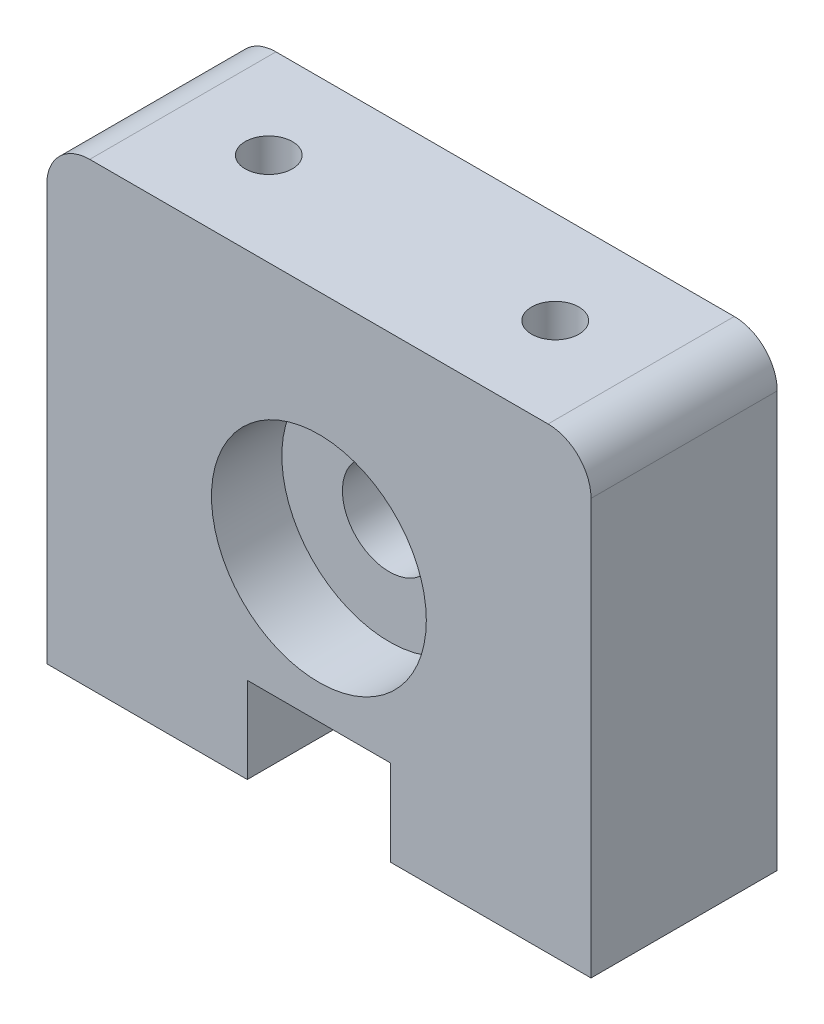
ISO-10303-21;
HEADER;
FILE_DESCRIPTION(('STEP AP214'),'2;1');
FILE_NAME('part.step','',(''),(''),'','','');
FILE_SCHEMA(('AUTOMOTIVE_DESIGN { 1 0 10303 214 1 1 1 1 }'));
ENDSEC;
DATA;
#1=APPLICATION_CONTEXT('core data for automotive mechanical design processes');
#2=APPLICATION_PROTOCOL_DEFINITION('international standard','automotive_design',2000,#1);
#3=PRODUCT_CONTEXT('',#1,'mechanical');
#4=PRODUCT('Part','Part','',(#3));
#5=PRODUCT_RELATED_PRODUCT_CATEGORY('part','',(#4));
#6=PRODUCT_DEFINITION_FORMATION('','',#4);
#7=PRODUCT_DEFINITION_CONTEXT('part definition',#1,'design');
#8=PRODUCT_DEFINITION('design','',#6,#7);
#9=PRODUCT_DEFINITION_SHAPE('','',#8);
#10=(LENGTH_UNIT() NAMED_UNIT(*) SI_UNIT(.MILLI.,.METRE.));
#11=(NAMED_UNIT(*) PLANE_ANGLE_UNIT() SI_UNIT($,.RADIAN.));
#12=(NAMED_UNIT(*) SI_UNIT($,.STERADIAN.) SOLID_ANGLE_UNIT());
#13=UNCERTAINTY_MEASURE_WITH_UNIT(LENGTH_MEASURE(1.E-05),#10,'distance_accuracy_value','');
#14=(GEOMETRIC_REPRESENTATION_CONTEXT(3) GLOBAL_UNCERTAINTY_ASSIGNED_CONTEXT((#13)) GLOBAL_UNIT_ASSIGNED_CONTEXT((#10,
#11,#12)) REPRESENTATION_CONTEXT('',''));
#15=CARTESIAN_POINT('',(0.,0.,0.));
#16=DIRECTION('',(0.,0.,1.));
#17=DIRECTION('',(1.,0.,0.));
#18=AXIS2_PLACEMENT_3D('',#15,#16,#17);
#19=CARTESIAN_POINT('',(0.,0.,13.));
#20=DIRECTION('',(0.,1.00000000000001,0.));
#21=DIRECTION('',(-1.00000000000001,0.,0.));
#22=AXIS2_PLACEMENT_3D('',#19,#20,#21);
#23=PLANE('',#22);
#24=CARTESIAN_POINT('',(-10.0000000000001,1.56125112837913E-13,6.5));
#25=DIRECTION('',(0.,-1.00000000000001,0.));
#26=DIRECTION('',(0.,0.,-1.));
#27=AXIS2_PLACEMENT_3D('',#24,#25,#26);
#28=CIRCLE('',#27,1.64999999999999);
#29=CARTESIAN_POINT('',(-10.0000000000001,1.56125112837913E-13,4.85000000000001));
#30=VERTEX_POINT('',#29);
#31=EDGE_CURVE('E521',#30,#30,#28,.T.);
#32=ORIENTED_EDGE('',*,*,#31,.F.);
#33=EDGE_LOOP('',(#32));
#34=FACE_BOUND('',#33,.T.);
#35=DIRECTION('',(1.00000000000001,0.,0.));
#36=VECTOR('',#35,1.);
#37=CARTESIAN_POINT('',(0.,0.,0.));
#38=LINE('',#37,#36);
#39=CARTESIAN_POINT('',(-19.,0.,0.));
#40=VERTEX_POINT('',#39);
#41=CARTESIAN_POINT('',(-5.,1.56125112837913E-13,0.));
#42=VERTEX_POINT('',#41);
#43=EDGE_CURVE('E167',#40,#42,#38,.T.);
#44=ORIENTED_EDGE('',*,*,#43,.T.);
#45=DIRECTION('',(0.,0.,1.));
#46=VECTOR('',#45,1.);
#47=CARTESIAN_POINT('',(-5.,0.,13.));
#48=LINE('',#47,#46);
#49=CARTESIAN_POINT('',(-5.,1.56125112837913E-13,13.));
#50=VERTEX_POINT('',#49);
#51=EDGE_CURVE('E62',#42,#50,#48,.T.);
#52=ORIENTED_EDGE('',*,*,#51,.T.);
#53=DIRECTION('',(1.00000000000001,0.,0.));
#54=VECTOR('',#53,1.);
#55=CARTESIAN_POINT('',(0.,0.,13.));
#56=LINE('',#55,#54);
#57=CARTESIAN_POINT('',(-19.,1.56125112837913E-13,13.));
#58=VERTEX_POINT('',#57);
#59=EDGE_CURVE('E131',#58,#50,#56,.T.);
#60=ORIENTED_EDGE('',*,*,#59,.F.);
#61=DIRECTION('',(0.,0.,-1.));
#62=VECTOR('',#61,1.);
#63=CARTESIAN_POINT('',(-19.,1.56125112837913E-13,13.));
#64=LINE('',#63,#62);
#65=EDGE_CURVE('E141',#58,#40,#64,.T.);
#66=ORIENTED_EDGE('',*,*,#65,.T.);
#67=EDGE_LOOP('',(#44,#52,#60,#66));
#68=FACE_BOUND('',#67,.T.);
#69=ADVANCED_FACE('F54',(#34,#68),#23,.F.);
#70=CARTESIAN_POINT('',(0.,15.8740000000002,13.));
#71=DIRECTION('',(0.,0.,-1.));
#72=DIRECTION('',(-1.00000000000001,0.,0.));
#73=AXIS2_PLACEMENT_3D('',#70,#71,#72);
#74=CYLINDRICAL_SURFACE('',#73,7.5);
#75=CARTESIAN_POINT('',(0.,15.8740000000002,0.));
#76=DIRECTION('',(0.,0.,1.));
#77=DIRECTION('',(1.00000000000001,0.,0.));
#78=AXIS2_PLACEMENT_3D('',#75,#76,#77);
#79=CIRCLE('',#78,7.5);
#80=CARTESIAN_POINT('',(7.50000000000008,15.8740000000002,0.));
#81=VERTEX_POINT('',#80);
#82=EDGE_CURVE('E186',#81,#81,#79,.T.);
#83=ORIENTED_EDGE('',*,*,#82,.F.);
#84=EDGE_LOOP('',(#83));
#85=FACE_BOUND('',#84,.T.);
#86=CARTESIAN_POINT('',(0.,15.8740000000002,4.9125));
#87=DIRECTION('',(0.,0.,1.));
#88=DIRECTION('',(1.00000000000001,0.,0.));
#89=AXIS2_PLACEMENT_3D('',#86,#87,#88);
#90=CIRCLE('',#89,7.5);
#91=CARTESIAN_POINT('',(7.50000000000008,15.8740000000002,4.9125));
#92=VERTEX_POINT('',#91);
#93=EDGE_CURVE('E183',#92,#92,#90,.T.);
#94=ORIENTED_EDGE('',*,*,#93,.T.);
#95=EDGE_LOOP('',(#94));
#96=FACE_BOUND('',#95,.T.);
#97=ADVANCED_FACE('F216',(#85,#96),#74,.F.);
#98=CARTESIAN_POINT('',(16.0000000000002,29.0000000000003,13.));
#99=DIRECTION('',(0.,0.,1.));
#100=DIRECTION('',(1.00000000000001,0.,0.));
#101=AXIS2_PLACEMENT_3D('',#98,#99,#100);
#102=PLANE('',#101);
#103=DIRECTION('',(0.,-1.,0.));
#104=VECTOR('',#103,1.);
#105=CARTESIAN_POINT('',(-5.,1.56125112837913E-13,13.));
#106=LINE('',#105,#104);
#107=CARTESIAN_POINT('',(-5.,6.00000000000016,13.));
#108=VERTEX_POINT('',#107);
#109=EDGE_CURVE('E496',#108,#50,#106,.T.);
#110=ORIENTED_EDGE('',*,*,#109,.F.);
#111=DIRECTION('',(-1.,0.,0.));
#112=VECTOR('',#111,1.);
#113=CARTESIAN_POINT('',(-5.,6.00000000000016,13.));
#114=LINE('',#113,#112);
#115=CARTESIAN_POINT('',(5.,6.00000000000016,13.));
#116=VERTEX_POINT('',#115);
#117=EDGE_CURVE('E504',#116,#108,#114,.T.);
#118=ORIENTED_EDGE('',*,*,#117,.F.);
#119=DIRECTION('',(0.,1.,0.));
#120=VECTOR('',#119,1.);
#121=CARTESIAN_POINT('',(5.,1.56125112837913E-13,13.));
#122=LINE('',#121,#120);
#123=CARTESIAN_POINT('',(5.,1.56125112837913E-13,13.));
#124=VERTEX_POINT('',#123);
#125=EDGE_CURVE('E505',#124,#116,#122,.T.);
#126=ORIENTED_EDGE('',*,*,#125,.F.);
#127=CARTESIAN_POINT('',(19.0000000000003,1.56125112837913E-13,13.0000000000001));
#128=VERTEX_POINT('',#127);
#129=EDGE_CURVE('E137',#124,#128,#56,.T.);
#130=ORIENTED_EDGE('',*,*,#129,.T.);
#131=DIRECTION('',(0.,1.00000000000001,0.));
#132=VECTOR('',#131,1.);
#133=CARTESIAN_POINT('',(19.0000000000003,1.56125112837913E-13,13.0000000000001));
#134=LINE('',#133,#132);
#135=CARTESIAN_POINT('',(19.0000000000003,29.0000000000003,13.0000000000001));
#136=VERTEX_POINT('',#135);
#137=EDGE_CURVE('E78',#128,#136,#134,.T.);
#138=ORIENTED_EDGE('',*,*,#137,.T.);
#139=CARTESIAN_POINT('',(16.0000000000002,29.0000000000003,13.));
#140=DIRECTION('',(0.,0.,1.));
#141=DIRECTION('',(1.00000000000001,0.,0.));
#142=AXIS2_PLACEMENT_3D('',#139,#140,#141);
#143=CIRCLE('',#142,3.);
#144=CARTESIAN_POINT('',(16.0000000000003,32.,13.));
#145=VERTEX_POINT('',#144);
#146=EDGE_CURVE('E170',#136,#145,#143,.T.);
#147=ORIENTED_EDGE('',*,*,#146,.T.);
#148=DIRECTION('',(-1.00000000000001,0.,0.));
#149=VECTOR('',#148,1.);
#150=CARTESIAN_POINT('',(-16.,32.0000000000003,13.0000000000001));
#151=LINE('',#150,#149);
#152=CARTESIAN_POINT('',(-16.,32.0000000000003,13.0000000000001));
#153=VERTEX_POINT('',#152);
#154=EDGE_CURVE('E114',#145,#153,#151,.T.);
#155=ORIENTED_EDGE('',*,*,#154,.T.);
#156=CARTESIAN_POINT('',(-16.,29.0000000000002,13.));
#157=DIRECTION('',(0.,0.,1.));
#158=DIRECTION('',(-1.00000000000001,0.,0.));
#159=AXIS2_PLACEMENT_3D('',#156,#157,#158);
#160=CIRCLE('',#159,3.);
#161=CARTESIAN_POINT('',(-19.,29.0000000000001,13.));
#162=VERTEX_POINT('',#161);
#163=EDGE_CURVE('E133',#153,#162,#160,.T.);
#164=ORIENTED_EDGE('',*,*,#163,.T.);
#165=DIRECTION('',(0.,-1.00000000000001,0.));
#166=VECTOR('',#165,1.);
#167=CARTESIAN_POINT('',(-19.,1.56125112837913E-13,13.));
#168=LINE('',#167,#166);
#169=EDGE_CURVE('E124',#162,#58,#168,.T.);
#170=ORIENTED_EDGE('',*,*,#169,.T.);
#171=ORIENTED_EDGE('',*,*,#59,.T.);
#172=EDGE_LOOP('',(#110,#118,#126,#130,#138,#147,#155,#164,#170,#171));
#173=FACE_BOUND('',#172,.T.);
#174=CARTESIAN_POINT('',(0.,15.8740000000002,13.));
#175=DIRECTION('',(0.,0.,1.));
#176=DIRECTION('',(1.00000000000001,0.,0.));
#177=AXIS2_PLACEMENT_3D('',#174,#175,#176);
#178=CIRCLE('',#177,7.5);
#179=CARTESIAN_POINT('',(7.50000000000008,15.8740000000002,13.));
#180=VERTEX_POINT('',#179);
#181=EDGE_CURVE('E161',#180,#180,#178,.T.);
#182=ORIENTED_EDGE('',*,*,#181,.F.);
#183=EDGE_LOOP('',(#182));
#184=FACE_BOUND('',#183,.T.);
#185=ADVANCED_FACE('F127',(#173,#184),#102,.T.);
#186=CARTESIAN_POINT('',(16.0000000000002,29.0000000000003,0.));
#187=DIRECTION('',(0.,0.,1.));
#188=DIRECTION('',(1.00000000000001,0.,0.));
#189=AXIS2_PLACEMENT_3D('',#186,#187,#188);
#190=PLANE('',#189);
#191=DIRECTION('',(-1.,0.,0.));
#192=VECTOR('',#191,1.);
#193=CARTESIAN_POINT('',(16.0000000000002,6.00000000000015,0.));
#194=LINE('',#193,#192);
#195=CARTESIAN_POINT('',(5.,6.00000000000016,0.));
#196=VERTEX_POINT('',#195);
#197=CARTESIAN_POINT('',(-5.,6.00000000000016,0.));
#198=VERTEX_POINT('',#197);
#199=EDGE_CURVE('E13',#196,#198,#194,.T.);
#200=ORIENTED_EDGE('',*,*,#199,.T.);
#201=DIRECTION('',(0.,-1.,0.));
#202=VECTOR('',#201,1.);
#203=CARTESIAN_POINT('',(-5.,29.0000000000003,0.));
#204=LINE('',#203,#202);
#205=EDGE_CURVE('E249',#198,#42,#204,.T.);
#206=ORIENTED_EDGE('',*,*,#205,.T.);
#207=ORIENTED_EDGE('',*,*,#43,.F.);
#208=DIRECTION('',(0.,-1.00000000000001,0.));
#209=VECTOR('',#208,1.);
#210=CARTESIAN_POINT('',(-19.,0.,0.));
#211=LINE('',#210,#209);
#212=CARTESIAN_POINT('',(-19.,29.0000000000003,0.));
#213=VERTEX_POINT('',#212);
#214=EDGE_CURVE('E144',#213,#40,#211,.T.);
#215=ORIENTED_EDGE('',*,*,#214,.F.);
#216=CARTESIAN_POINT('',(-16.,29.0000000000003,0.));
#217=DIRECTION('',(0.,0.,1.));
#218=DIRECTION('',(-1.00000000000001,0.,0.));
#219=AXIS2_PLACEMENT_3D('',#216,#217,#218);
#220=CIRCLE('',#219,3.);
#221=CARTESIAN_POINT('',(-16.,32.0000000000003,0.));
#222=VERTEX_POINT('',#221);
#223=EDGE_CURVE('E163',#222,#213,#220,.T.);
#224=ORIENTED_EDGE('',*,*,#223,.F.);
#225=DIRECTION('',(-1.00000000000001,0.,0.));
#226=VECTOR('',#225,1.);
#227=CARTESIAN_POINT('',(-16.,32.0000000000003,0.));
#228=LINE('',#227,#226);
#229=CARTESIAN_POINT('',(16.0000000000003,32.,0.));
#230=VERTEX_POINT('',#229);
#231=EDGE_CURVE('E160',#230,#222,#228,.T.);
#232=ORIENTED_EDGE('',*,*,#231,.F.);
#233=CARTESIAN_POINT('',(16.0000000000002,29.0000000000003,0.));
#234=DIRECTION('',(0.,0.,1.));
#235=DIRECTION('',(1.00000000000001,0.,0.));
#236=AXIS2_PLACEMENT_3D('',#233,#234,#235);
#237=CIRCLE('',#236,3.);
#238=CARTESIAN_POINT('',(19.0000000000003,29.0000000000003,0.));
#239=VERTEX_POINT('',#238);
#240=EDGE_CURVE('E157',#239,#230,#237,.T.);
#241=ORIENTED_EDGE('',*,*,#240,.F.);
#242=DIRECTION('',(0.,1.00000000000001,0.));
#243=VECTOR('',#242,1.);
#244=CARTESIAN_POINT('',(19.0000000000003,1.56125112837913E-13,0.));
#245=LINE('',#244,#243);
#246=CARTESIAN_POINT('',(19.0000000000003,1.56125112837913E-13,0.));
#247=VERTEX_POINT('',#246);
#248=EDGE_CURVE('E105',#247,#239,#245,.T.);
#249=ORIENTED_EDGE('',*,*,#248,.F.);
#250=CARTESIAN_POINT('',(5.0000000000001,0.,0.));
#251=VERTEX_POINT('',#250);
#252=EDGE_CURVE('E166',#251,#247,#38,.T.);
#253=ORIENTED_EDGE('',*,*,#252,.F.);
#254=DIRECTION('',(0.,1.,0.));
#255=VECTOR('',#254,1.);
#256=CARTESIAN_POINT('',(5.,29.0000000000003,0.));
#257=LINE('',#256,#255);
#258=EDGE_CURVE('E69',#251,#196,#257,.T.);
#259=ORIENTED_EDGE('',*,*,#258,.T.);
#260=EDGE_LOOP('',(#200,#206,#207,#215,#224,#232,#241,#249,#253,#259));
#261=FACE_BOUND('',#260,.T.);
#262=ORIENTED_EDGE('',*,*,#82,.T.);
#263=EDGE_LOOP('',(#262));
#264=FACE_BOUND('',#263,.T.);
#265=ADVANCED_FACE('F197',(#261,#264),#190,.F.);
#266=CARTESIAN_POINT('',(16.0000000000002,29.0000000000003,13.));
#267=DIRECTION('',(0.,0.,-1.));
#268=DIRECTION('',(-1.00000000000001,0.,0.));
#269=AXIS2_PLACEMENT_3D('',#266,#267,#268);
#270=CYLINDRICAL_SURFACE('',#269,3.);
#271=ORIENTED_EDGE('',*,*,#240,.T.);
#272=DIRECTION('',(0.,0.,-1.));
#273=VECTOR('',#272,1.);
#274=CARTESIAN_POINT('',(16.0000000000003,32.,13.));
#275=LINE('',#274,#273);
#276=EDGE_CURVE('E177',#145,#230,#275,.T.);
#277=ORIENTED_EDGE('',*,*,#276,.F.);
#278=ORIENTED_EDGE('',*,*,#146,.F.);
#279=DIRECTION('',(0.,0.,-1.));
#280=VECTOR('',#279,1.);
#281=CARTESIAN_POINT('',(19.0000000000003,29.0000000000003,13.0000000000001));
#282=LINE('',#281,#280);
#283=EDGE_CURVE('E153',#136,#239,#282,.T.);
#284=ORIENTED_EDGE('',*,*,#283,.T.);
#285=EDGE_LOOP('',(#271,#277,#278,#284));
#286=FACE_BOUND('',#285,.T.);
#287=ADVANCED_FACE('F56',(#286),#270,.T.);
#288=CARTESIAN_POINT('',(-16.,32.0000000000003,13.0000000000001));
#289=DIRECTION('',(0.,-1.00000000000001,0.));
#290=DIRECTION('',(0.,0.,-1.));
#291=AXIS2_PLACEMENT_3D('',#288,#289,#290);
#292=PLANE('',#291);
#293=CARTESIAN_POINT('',(-10.0000000000001,32.0000000000003,6.5));
#294=DIRECTION('',(0.,1.00000000000001,0.));
#295=DIRECTION('',(0.,0.,1.));
#296=AXIS2_PLACEMENT_3D('',#293,#294,#295);
#297=CIRCLE('',#296,1.64999999999999);
#298=CARTESIAN_POINT('',(-10.0000000000001,32.0000000000003,8.14999999999999));
#299=VERTEX_POINT('',#298);
#300=EDGE_CURVE('E242',#299,#299,#297,.T.);
#301=ORIENTED_EDGE('',*,*,#300,.F.);
#302=EDGE_LOOP('',(#301));
#303=FACE_BOUND('',#302,.T.);
#304=CARTESIAN_POINT('',(10.,32.0000000000003,6.5));
#305=DIRECTION('',(0.,1.00000000000001,0.));
#306=DIRECTION('',(0.,0.,1.));
#307=AXIS2_PLACEMENT_3D('',#304,#305,#306);
#308=CIRCLE('',#307,1.64999999999999);
#309=CARTESIAN_POINT('',(10.,32.0000000000003,8.14999999999999));
#310=VERTEX_POINT('',#309);
#311=EDGE_CURVE('E245',#310,#310,#308,.T.);
#312=ORIENTED_EDGE('',*,*,#311,.F.);
#313=EDGE_LOOP('',(#312));
#314=FACE_BOUND('',#313,.T.);
#315=ORIENTED_EDGE('',*,*,#231,.T.);
#316=DIRECTION('',(0.,0.,-1.));
#317=VECTOR('',#316,1.);
#318=CARTESIAN_POINT('',(-16.,32.0000000000003,13.0000000000001));
#319=LINE('',#318,#317);
#320=EDGE_CURVE('E174',#153,#222,#319,.T.);
#321=ORIENTED_EDGE('',*,*,#320,.F.);
#322=ORIENTED_EDGE('',*,*,#154,.F.);
#323=ORIENTED_EDGE('',*,*,#276,.T.);
#324=EDGE_LOOP('',(#315,#321,#322,#323));
#325=FACE_BOUND('',#324,.T.);
#326=ADVANCED_FACE('F232',(#303,#314,#325),#292,.F.);
#327=CARTESIAN_POINT('',(-16.,29.0000000000002,13.));
#328=DIRECTION('',(0.,0.,-1.));
#329=DIRECTION('',(-1.00000000000001,0.,0.));
#330=AXIS2_PLACEMENT_3D('',#327,#328,#329);
#331=CYLINDRICAL_SURFACE('',#330,3.);
#332=ORIENTED_EDGE('',*,*,#223,.T.);
#333=DIRECTION('',(0.,0.,-1.));
#334=VECTOR('',#333,1.);
#335=CARTESIAN_POINT('',(-19.,29.0000000000001,13.));
#336=LINE('',#335,#334);
#337=EDGE_CURVE('E147',#162,#213,#336,.T.);
#338=ORIENTED_EDGE('',*,*,#337,.F.);
#339=ORIENTED_EDGE('',*,*,#163,.F.);
#340=ORIENTED_EDGE('',*,*,#320,.T.);
#341=EDGE_LOOP('',(#332,#338,#339,#340));
#342=FACE_BOUND('',#341,.T.);
#343=ADVANCED_FACE('F230',(#342),#331,.T.);
#344=CARTESIAN_POINT('',(-19.,1.56125112837913E-13,13.));
#345=DIRECTION('',(1.00000000000001,0.,0.));
#346=DIRECTION('',(0.,0.,-1.));
#347=AXIS2_PLACEMENT_3D('',#344,#345,#346);
#348=PLANE('',#347);
#349=ORIENTED_EDGE('',*,*,#214,.T.);
#350=ORIENTED_EDGE('',*,*,#65,.F.);
#351=ORIENTED_EDGE('',*,*,#169,.F.);
#352=ORIENTED_EDGE('',*,*,#337,.T.);
#353=EDGE_LOOP('',(#349,#350,#351,#352));
#354=FACE_BOUND('',#353,.T.);
#355=ADVANCED_FACE('F142',(#354),#348,.F.);
#356=CARTESIAN_POINT('',(10.,0.,6.5));
#357=DIRECTION('',(0.,-1.00000000000001,0.));
#358=DIRECTION('',(0.,0.,-1.));
#359=AXIS2_PLACEMENT_3D('',#356,#357,#358);
#360=CIRCLE('',#359,1.64999999999999);
#361=CARTESIAN_POINT('',(10.,0.,4.85000000000001));
#362=VERTEX_POINT('',#361);
#363=EDGE_CURVE('E278',#362,#362,#360,.T.);
#364=ORIENTED_EDGE('',*,*,#363,.F.);
#365=EDGE_LOOP('',(#364));
#366=FACE_BOUND('',#365,.T.);
#367=ORIENTED_EDGE('',*,*,#129,.F.);
#368=DIRECTION('',(0.,0.,-1.));
#369=VECTOR('',#368,1.);
#370=CARTESIAN_POINT('',(5.,0.,13.));
#371=LINE('',#370,#369);
#372=EDGE_CURVE('E182',#124,#251,#371,.T.);
#373=ORIENTED_EDGE('',*,*,#372,.T.);
#374=ORIENTED_EDGE('',*,*,#252,.T.);
#375=DIRECTION('',(0.,0.,-1.));
#376=VECTOR('',#375,1.);
#377=CARTESIAN_POINT('',(19.0000000000003,1.56125112837913E-13,13.0000000000001));
#378=LINE('',#377,#376);
#379=EDGE_CURVE('E148',#128,#247,#378,.T.);
#380=ORIENTED_EDGE('',*,*,#379,.F.);
#381=EDGE_LOOP('',(#367,#373,#374,#380));
#382=FACE_BOUND('',#381,.T.);
#383=ADVANCED_FACE('F191',(#366,#382),#23,.F.);
#384=CARTESIAN_POINT('',(19.0000000000003,1.56125112837913E-13,13.0000000000001));
#385=DIRECTION('',(-1.00000000000001,0.,0.));
#386=DIRECTION('',(0.,0.,1.));
#387=AXIS2_PLACEMENT_3D('',#384,#385,#386);
#388=PLANE('',#387);
#389=ORIENTED_EDGE('',*,*,#248,.T.);
#390=ORIENTED_EDGE('',*,*,#283,.F.);
#391=ORIENTED_EDGE('',*,*,#137,.F.);
#392=ORIENTED_EDGE('',*,*,#379,.T.);
#393=EDGE_LOOP('',(#389,#390,#391,#392));
#394=FACE_BOUND('',#393,.T.);
#395=ADVANCED_FACE('F205',(#394),#388,.F.);
#396=CARTESIAN_POINT('',(0.,15.8740000000002,8.0875));
#397=DIRECTION('',(0.,0.,1.));
#398=DIRECTION('',(1.00000000000001,0.,0.));
#399=AXIS2_PLACEMENT_3D('',#396,#397,#398);
#400=CIRCLE('',#399,7.5);
#401=CARTESIAN_POINT('',(7.50000000000008,15.8740000000002,8.0875));
#402=VERTEX_POINT('',#401);
#403=EDGE_CURVE('E179',#402,#402,#400,.T.);
#404=ORIENTED_EDGE('',*,*,#403,.F.);
#405=EDGE_LOOP('',(#404));
#406=FACE_BOUND('',#405,.T.);
#407=ORIENTED_EDGE('',*,*,#181,.T.);
#408=EDGE_LOOP('',(#407));
#409=FACE_BOUND('',#408,.T.);
#410=ADVANCED_FACE('F207',(#406,#409),#74,.F.);
#411=CARTESIAN_POINT('',(0.,15.8740000000002,4.9125));
#412=DIRECTION('',(0.,0.,1.));
#413=DIRECTION('',(1.00000000000001,0.,0.));
#414=AXIS2_PLACEMENT_3D('',#411,#412,#413);
#415=PLANE('',#414);
#416=ORIENTED_EDGE('',*,*,#93,.F.);
#417=EDGE_LOOP('',(#416));
#418=FACE_BOUND('',#417,.T.);
#419=CARTESIAN_POINT('',(0.,15.8740000000002,4.9125));
#420=DIRECTION('',(0.,0.,1.));
#421=DIRECTION('',(1.00000000000001,0.,0.));
#422=AXIS2_PLACEMENT_3D('',#419,#420,#421);
#423=CIRCLE('',#422,3.27025);
#424=CARTESIAN_POINT('',(3.27025000000003,15.8740000000002,4.9125));
#425=VERTEX_POINT('',#424);
#426=EDGE_CURVE('E187',#425,#425,#423,.T.);
#427=ORIENTED_EDGE('',*,*,#426,.T.);
#428=EDGE_LOOP('',(#427));
#429=FACE_BOUND('',#428,.T.);
#430=ADVANCED_FACE('F213',(#418,#429),#415,.F.);
#431=CARTESIAN_POINT('',(0.,15.8740000000002,4.9125));
#432=DIRECTION('',(0.,0.,1.));
#433=DIRECTION('',(1.00000000000001,0.,0.));
#434=AXIS2_PLACEMENT_3D('',#431,#432,#433);
#435=CYLINDRICAL_SURFACE('',#434,3.27025);
#436=ORIENTED_EDGE('',*,*,#426,.F.);
#437=EDGE_LOOP('',(#436));
#438=FACE_BOUND('',#437,.T.);
#439=CARTESIAN_POINT('',(0.,15.8740000000002,8.0875));
#440=DIRECTION('',(0.,0.,1.));
#441=DIRECTION('',(1.00000000000001,0.,0.));
#442=AXIS2_PLACEMENT_3D('',#439,#440,#441);
#443=CIRCLE('',#442,3.27025);
#444=CARTESIAN_POINT('',(3.27025000000003,15.8740000000002,8.0875));
#445=VERTEX_POINT('',#444);
#446=EDGE_CURVE('E277',#445,#445,#443,.T.);
#447=ORIENTED_EDGE('',*,*,#446,.T.);
#448=EDGE_LOOP('',(#447));
#449=FACE_BOUND('',#448,.T.);
#450=ADVANCED_FACE('F300',(#438,#449),#435,.F.);
#451=CARTESIAN_POINT('',(0.,15.8740000000002,8.0875));
#452=DIRECTION('',(0.,0.,1.));
#453=DIRECTION('',(1.00000000000001,0.,0.));
#454=AXIS2_PLACEMENT_3D('',#451,#452,#453);
#455=PLANE('',#454);
#456=ORIENTED_EDGE('',*,*,#403,.T.);
#457=EDGE_LOOP('',(#456));
#458=FACE_BOUND('',#457,.T.);
#459=ORIENTED_EDGE('',*,*,#446,.F.);
#460=EDGE_LOOP('',(#459));
#461=FACE_BOUND('',#460,.T.);
#462=ADVANCED_FACE('F271',(#458,#461),#455,.T.);
#463=CARTESIAN_POINT('',(10.0000000000001,10.1092000000002,6.5));
#464=DIRECTION('',(0.,-1.00000000000001,0.));
#465=DIRECTION('',(0.,0.,-1.));
#466=AXIS2_PLACEMENT_3D('',#463,#464,#465);
#467=CONICAL_SURFACE('',#466,1.65,1.02974425867665);
#468=CARTESIAN_POINT('',(10.0000000000001,11.1006200213956,6.5));
#469=VERTEX_POINT('',#468);
#470=VERTEX_LOOP('',#469);
#471=FACE_BOUND('',#470,.T.);
#472=CARTESIAN_POINT('',(10.0000000000001,10.1092000000002,6.5));
#473=DIRECTION('',(0.,-1.00000000000001,0.));
#474=DIRECTION('',(0.,0.,-1.));
#475=AXIS2_PLACEMENT_3D('',#472,#473,#474);
#476=CIRCLE('',#475,1.65);
#477=CARTESIAN_POINT('',(10.0000000000001,10.1092000000002,4.85));
#478=VERTEX_POINT('',#477);
#479=EDGE_CURVE('E275',#478,#478,#476,.T.);
#480=ORIENTED_EDGE('',*,*,#479,.T.);
#481=EDGE_LOOP('',(#480));
#482=FACE_BOUND('',#481,.T.);
#483=ADVANCED_FACE('F267',(#471,#482),#467,.F.);
#484=CARTESIAN_POINT('',(10.,0.,6.5));
#485=DIRECTION('',(0.,-1.00000000000001,0.));
#486=DIRECTION('',(0.,0.,-1.));
#487=AXIS2_PLACEMENT_3D('',#484,#485,#486);
#488=CYLINDRICAL_SURFACE('',#487,1.64999999999999);
#489=ORIENTED_EDGE('',*,*,#479,.F.);
#490=EDGE_LOOP('',(#489));
#491=FACE_BOUND('',#490,.T.);
#492=ORIENTED_EDGE('',*,*,#363,.T.);
#493=EDGE_LOOP('',(#492));
#494=FACE_BOUND('',#493,.T.);
#495=ADVANCED_FACE('F270',(#491,#494),#488,.F.);
#496=CARTESIAN_POINT('',(-10.0000000000001,10.1092000000001,6.5));
#497=DIRECTION('',(0.,-1.00000000000001,0.));
#498=DIRECTION('',(0.,0.,-1.));
#499=AXIS2_PLACEMENT_3D('',#496,#497,#498);
#500=CONICAL_SURFACE('',#499,1.65,1.02974425867665);
#501=CARTESIAN_POINT('',(-10.0000000000001,11.1006200213956,6.5));
#502=VERTEX_POINT('',#501);
#503=VERTEX_LOOP('',#502);
#504=FACE_BOUND('',#503,.T.);
#505=CARTESIAN_POINT('',(-10.0000000000001,10.1092000000001,6.5));
#506=DIRECTION('',(0.,-1.00000000000001,0.));
#507=DIRECTION('',(0.,0.,-1.));
#508=AXIS2_PLACEMENT_3D('',#505,#506,#507);
#509=CIRCLE('',#508,1.65);
#510=CARTESIAN_POINT('',(-10.0000000000001,10.1092000000001,4.85));
#511=VERTEX_POINT('',#510);
#512=EDGE_CURVE('E283',#511,#511,#509,.T.);
#513=ORIENTED_EDGE('',*,*,#512,.T.);
#514=EDGE_LOOP('',(#513));
#515=FACE_BOUND('',#514,.T.);
#516=ADVANCED_FACE('F392',(#504,#515),#500,.F.);
#517=CARTESIAN_POINT('',(-10.0000000000001,1.56125112837913E-13,6.5));
#518=DIRECTION('',(0.,-1.00000000000001,0.));
#519=DIRECTION('',(0.,0.,-1.));
#520=AXIS2_PLACEMENT_3D('',#517,#518,#519);
#521=CYLINDRICAL_SURFACE('',#520,1.64999999999999);
#522=ORIENTED_EDGE('',*,*,#512,.F.);
#523=EDGE_LOOP('',(#522));
#524=FACE_BOUND('',#523,.T.);
#525=ORIENTED_EDGE('',*,*,#31,.T.);
#526=EDGE_LOOP('',(#525));
#527=FACE_BOUND('',#526,.T.);
#528=ADVANCED_FACE('F401',(#524,#527),#521,.F.);
#529=CARTESIAN_POINT('',(10.0000000000001,22.0000000000002,6.5));
#530=DIRECTION('',(0.,1.00000000000001,0.));
#531=DIRECTION('',(0.,0.,1.));
#532=AXIS2_PLACEMENT_3D('',#529,#530,#531);
#533=CONICAL_SURFACE('',#532,1.64999999999999,1.02974425867665);
#534=CARTESIAN_POINT('',(10.0000000000001,21.0085799786047,6.5));
#535=VERTEX_POINT('',#534);
#536=VERTEX_LOOP('',#535);
#537=FACE_BOUND('',#536,.T.);
#538=CARTESIAN_POINT('',(10.0000000000001,22.0000000000002,6.5));
#539=DIRECTION('',(0.,1.00000000000001,0.));
#540=DIRECTION('',(0.,0.,1.));
#541=AXIS2_PLACEMENT_3D('',#538,#539,#540);
#542=CIRCLE('',#541,1.64999999999999);
#543=CARTESIAN_POINT('',(10.0000000000001,22.0000000000002,8.14999999999999));
#544=VERTEX_POINT('',#543);
#545=EDGE_CURVE('E518',#544,#544,#542,.T.);
#546=ORIENTED_EDGE('',*,*,#545,.T.);
#547=EDGE_LOOP('',(#546));
#548=FACE_BOUND('',#547,.T.);
#549=ADVANCED_FACE('F410',(#537,#548),#533,.F.);
#550=CARTESIAN_POINT('',(10.,32.0000000000003,6.5));
#551=DIRECTION('',(0.,1.00000000000001,0.));
#552=DIRECTION('',(0.,0.,1.));
#553=AXIS2_PLACEMENT_3D('',#550,#551,#552);
#554=CYLINDRICAL_SURFACE('',#553,1.64999999999999);
#555=ORIENTED_EDGE('',*,*,#545,.F.);
#556=EDGE_LOOP('',(#555));
#557=FACE_BOUND('',#556,.T.);
#558=ORIENTED_EDGE('',*,*,#311,.T.);
#559=EDGE_LOOP('',(#558));
#560=FACE_BOUND('',#559,.T.);
#561=ADVANCED_FACE('F421',(#557,#560),#554,.F.);
#562=CARTESIAN_POINT('',(-10.0000000000001,22.0000000000003,6.5));
#563=DIRECTION('',(0.,1.00000000000001,0.));
#564=DIRECTION('',(0.,0.,1.));
#565=AXIS2_PLACEMENT_3D('',#562,#563,#564);
#566=CONICAL_SURFACE('',#565,1.64999999999999,1.02974425867665);
#567=CARTESIAN_POINT('',(-10.0000000000001,21.0085799786048,6.5));
#568=VERTEX_POINT('',#567);
#569=VERTEX_LOOP('',#568);
#570=FACE_BOUND('',#569,.T.);
#571=CARTESIAN_POINT('',(-10.0000000000001,22.0000000000003,6.5));
#572=DIRECTION('',(0.,1.00000000000001,0.));
#573=DIRECTION('',(0.,0.,1.));
#574=AXIS2_PLACEMENT_3D('',#571,#572,#573);
#575=CIRCLE('',#574,1.64999999999999);
#576=CARTESIAN_POINT('',(-10.0000000000001,22.0000000000003,8.14999999999998));
#577=VERTEX_POINT('',#576);
#578=EDGE_CURVE('E514',#577,#577,#575,.T.);
#579=ORIENTED_EDGE('',*,*,#578,.T.);
#580=EDGE_LOOP('',(#579));
#581=FACE_BOUND('',#580,.T.);
#582=ADVANCED_FACE('F431',(#570,#581),#566,.F.);
#583=CARTESIAN_POINT('',(-10.0000000000001,32.0000000000003,6.5));
#584=DIRECTION('',(0.,1.00000000000001,0.));
#585=DIRECTION('',(0.,0.,1.));
#586=AXIS2_PLACEMENT_3D('',#583,#584,#585);
#587=CYLINDRICAL_SURFACE('',#586,1.64999999999999);
#588=ORIENTED_EDGE('',*,*,#578,.F.);
#589=EDGE_LOOP('',(#588));
#590=FACE_BOUND('',#589,.T.);
#591=ORIENTED_EDGE('',*,*,#300,.T.);
#592=EDGE_LOOP('',(#591));
#593=FACE_BOUND('',#592,.T.);
#594=ADVANCED_FACE('F442',(#590,#593),#587,.F.);
#595=CARTESIAN_POINT('',(-5.,6.00000000000016,-2.));
#596=DIRECTION('',(0.,1.,0.));
#597=DIRECTION('',(0.,0.,1.));
#598=AXIS2_PLACEMENT_3D('',#595,#596,#597);
#599=PLANE('',#598);
#600=DIRECTION('',(0.,0.,1.));
#601=VECTOR('',#600,1.);
#602=CARTESIAN_POINT('',(5.,6.00000000000016,-2.));
#603=LINE('',#602,#601);
#604=EDGE_CURVE('E500',#196,#116,#603,.T.);
#605=ORIENTED_EDGE('',*,*,#604,.T.);
#606=ORIENTED_EDGE('',*,*,#117,.T.);
#607=DIRECTION('',(0.,0.,1.));
#608=VECTOR('',#607,1.);
#609=CARTESIAN_POINT('',(-5.,6.00000000000016,-2.));
#610=LINE('',#609,#608);
#611=EDGE_CURVE('E494',#198,#108,#610,.T.);
#612=ORIENTED_EDGE('',*,*,#611,.F.);
#613=ORIENTED_EDGE('',*,*,#199,.F.);
#614=EDGE_LOOP('',(#605,#606,#612,#613));
#615=FACE_BOUND('',#614,.T.);
#616=ADVANCED_FACE('F452',(#615),#599,.F.);
#617=CARTESIAN_POINT('',(-5.,1.56125112837913E-13,-2.));
#618=DIRECTION('',(-1.,0.,0.));
#619=DIRECTION('',(0.,0.,1.));
#620=AXIS2_PLACEMENT_3D('',#617,#618,#619);
#621=PLANE('',#620);
#622=ORIENTED_EDGE('',*,*,#611,.T.);
#623=ORIENTED_EDGE('',*,*,#109,.T.);
#624=ORIENTED_EDGE('',*,*,#51,.F.);
#625=ORIENTED_EDGE('',*,*,#205,.F.);
#626=EDGE_LOOP('',(#622,#623,#624,#625));
#627=FACE_BOUND('',#626,.T.);
#628=ADVANCED_FACE('F466',(#627),#621,.F.);
#629=CARTESIAN_POINT('',(5.,1.56125112837913E-13,-2.));
#630=DIRECTION('',(1.,0.,0.));
#631=DIRECTION('',(0.,0.,-1.));
#632=AXIS2_PLACEMENT_3D('',#629,#630,#631);
#633=PLANE('',#632);
#634=ORIENTED_EDGE('',*,*,#372,.F.);
#635=ORIENTED_EDGE('',*,*,#125,.T.);
#636=ORIENTED_EDGE('',*,*,#604,.F.);
#637=ORIENTED_EDGE('',*,*,#258,.F.);
#638=EDGE_LOOP('',(#634,#635,#636,#637));
#639=FACE_BOUND('',#638,.T.);
#640=ADVANCED_FACE('F474',(#639),#633,.F.);
#641=CLOSED_SHELL('',(#69,#97,#185,#265,#287,#326,#343,#355,#383,#395,#410,#430,#450,#462,#483,
#495,#516,#528,#549,#561,#582,#594,#616,#628,#640));
#642=MANIFOLD_SOLID_BREP('B2',#641);
#643=ADVANCED_BREP_SHAPE_REPRESENTATION('',(#18,#642),#14);
#644=SHAPE_DEFINITION_REPRESENTATION(#9,#643);
ENDSEC;
END-ISO-10303-21;
